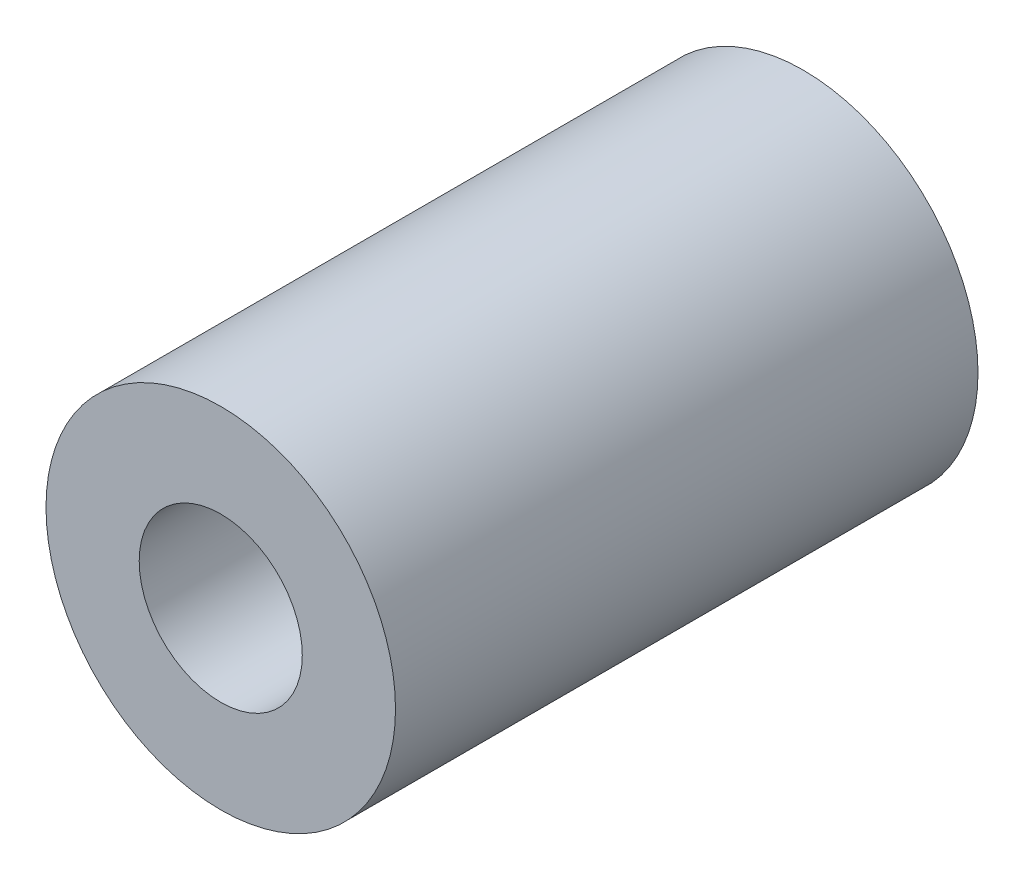
ISO-10303-21;
HEADER;
FILE_DESCRIPTION(('STEP AP214'),'2;1');
FILE_NAME('part.step','',(''),(''),'','','');
FILE_SCHEMA(('AUTOMOTIVE_DESIGN { 1 0 10303 214 1 1 1 1 }'));
ENDSEC;
DATA;
#1=APPLICATION_CONTEXT('core data for automotive mechanical design processes');
#2=APPLICATION_PROTOCOL_DEFINITION('international standard','automotive_design',2000,#1);
#3=PRODUCT_CONTEXT('',#1,'mechanical');
#4=PRODUCT('Part','Part','',(#3));
#5=PRODUCT_RELATED_PRODUCT_CATEGORY('part','',(#4));
#6=PRODUCT_DEFINITION_FORMATION('','',#4);
#7=PRODUCT_DEFINITION_CONTEXT('part definition',#1,'design');
#8=PRODUCT_DEFINITION('design','',#6,#7);
#9=PRODUCT_DEFINITION_SHAPE('','',#8);
#10=(LENGTH_UNIT() NAMED_UNIT(*) SI_UNIT(.MILLI.,.METRE.));
#11=(NAMED_UNIT(*) PLANE_ANGLE_UNIT() SI_UNIT($,.RADIAN.));
#12=(NAMED_UNIT(*) SI_UNIT($,.STERADIAN.) SOLID_ANGLE_UNIT());
#13=UNCERTAINTY_MEASURE_WITH_UNIT(LENGTH_MEASURE(1.E-05),#10,'distance_accuracy_value','');
#14=(GEOMETRIC_REPRESENTATION_CONTEXT(3) GLOBAL_UNCERTAINTY_ASSIGNED_CONTEXT((#13)) GLOBAL_UNIT_ASSIGNED_CONTEXT((#10,
#11,#12)) REPRESENTATION_CONTEXT('',''));
#15=CARTESIAN_POINT('',(0.,0.,0.));
#16=DIRECTION('',(0.,0.,1.));
#17=DIRECTION('',(1.,0.,0.));
#18=AXIS2_PLACEMENT_3D('',#15,#16,#17);
#19=CARTESIAN_POINT('',(-65.,0.,25.));
#20=DIRECTION('',(0.,0.,1.));
#21=DIRECTION('',(1.,0.,0.));
#22=AXIS2_PLACEMENT_3D('',#19,#20,#21);
#23=PLANE('',#22);
#24=CARTESIAN_POINT('',(-65.,0.,25.));
#25=DIRECTION('',(0.,0.,1.));
#26=DIRECTION('',(1.,0.,0.));
#27=AXIS2_PLACEMENT_3D('',#24,#25,#26);
#28=CIRCLE('',#27,15.);
#29=CARTESIAN_POINT('',(-50.,0.,25.));
#30=VERTEX_POINT('',#29);
#31=EDGE_CURVE('E10',#30,#30,#28,.T.);
#32=ORIENTED_EDGE('',*,*,#31,.T.);
#33=EDGE_LOOP('',(#32));
#34=FACE_BOUND('',#33,.T.);
#35=CARTESIAN_POINT('',(-65.,0.,25.));
#36=DIRECTION('',(0.,0.,1.));
#37=DIRECTION('',(1.,0.,0.));
#38=AXIS2_PLACEMENT_3D('',#35,#36,#37);
#39=CIRCLE('',#38,7.);
#40=CARTESIAN_POINT('',(-58.,0.,25.));
#41=VERTEX_POINT('',#40);
#42=EDGE_CURVE('E44',#41,#41,#39,.T.);
#43=ORIENTED_EDGE('',*,*,#42,.F.);
#44=EDGE_LOOP('',(#43));
#45=FACE_BOUND('',#44,.T.);
#46=ADVANCED_FACE('F33',(#34,#45),#23,.T.);
#47=CARTESIAN_POINT('',(-65.,0.,-25.));
#48=DIRECTION('',(0.,0.,1.));
#49=DIRECTION('',(1.,0.,0.));
#50=AXIS2_PLACEMENT_3D('',#47,#48,#49);
#51=PLANE('',#50);
#52=CARTESIAN_POINT('',(-65.,0.,-25.));
#53=DIRECTION('',(0.,0.,1.));
#54=DIRECTION('',(1.,0.,0.));
#55=AXIS2_PLACEMENT_3D('',#52,#53,#54);
#56=CIRCLE('',#55,15.);
#57=CARTESIAN_POINT('',(-50.,0.,-25.));
#58=VERTEX_POINT('',#57);
#59=EDGE_CURVE('E37',#58,#58,#56,.T.);
#60=ORIENTED_EDGE('',*,*,#59,.F.);
#61=EDGE_LOOP('',(#60));
#62=FACE_BOUND('',#61,.T.);
#63=CARTESIAN_POINT('',(-65.,0.,-25.));
#64=DIRECTION('',(0.,0.,1.));
#65=DIRECTION('',(1.,0.,0.));
#66=AXIS2_PLACEMENT_3D('',#63,#64,#65);
#67=CIRCLE('',#66,7.);
#68=CARTESIAN_POINT('',(-58.,0.,-25.));
#69=VERTEX_POINT('',#68);
#70=EDGE_CURVE('E46',#69,#69,#67,.T.);
#71=ORIENTED_EDGE('',*,*,#70,.T.);
#72=EDGE_LOOP('',(#71));
#73=FACE_BOUND('',#72,.T.);
#74=ADVANCED_FACE('F56',(#62,#73),#51,.F.);
#75=CARTESIAN_POINT('',(-65.,0.,25.));
#76=DIRECTION('',(0.,0.,-1.));
#77=DIRECTION('',(-1.,0.,0.));
#78=AXIS2_PLACEMENT_3D('',#75,#76,#77);
#79=CYLINDRICAL_SURFACE('',#78,15.);
#80=ORIENTED_EDGE('',*,*,#31,.F.);
#81=EDGE_LOOP('',(#80));
#82=FACE_BOUND('',#81,.T.);
#83=ORIENTED_EDGE('',*,*,#59,.T.);
#84=EDGE_LOOP('',(#83));
#85=FACE_BOUND('',#84,.T.);
#86=ADVANCED_FACE('F35',(#82,#85),#79,.T.);
#87=CARTESIAN_POINT('',(-65.,0.,25.));
#88=DIRECTION('',(0.,0.,-1.));
#89=DIRECTION('',(-1.,0.,0.));
#90=AXIS2_PLACEMENT_3D('',#87,#88,#89);
#91=CYLINDRICAL_SURFACE('',#90,7.);
#92=ORIENTED_EDGE('',*,*,#42,.T.);
#93=EDGE_LOOP('',(#92));
#94=FACE_BOUND('',#93,.T.);
#95=ORIENTED_EDGE('',*,*,#70,.F.);
#96=EDGE_LOOP('',(#95));
#97=FACE_BOUND('',#96,.T.);
#98=ADVANCED_FACE('F52',(#94,#97),#91,.F.);
#99=CLOSED_SHELL('',(#46,#74,#86,#98));
#100=MANIFOLD_SOLID_BREP('B2',#99);
#101=ADVANCED_BREP_SHAPE_REPRESENTATION('',(#18,#100),#14);
#102=SHAPE_DEFINITION_REPRESENTATION(#9,#101);
ENDSEC;
END-ISO-10303-21;
